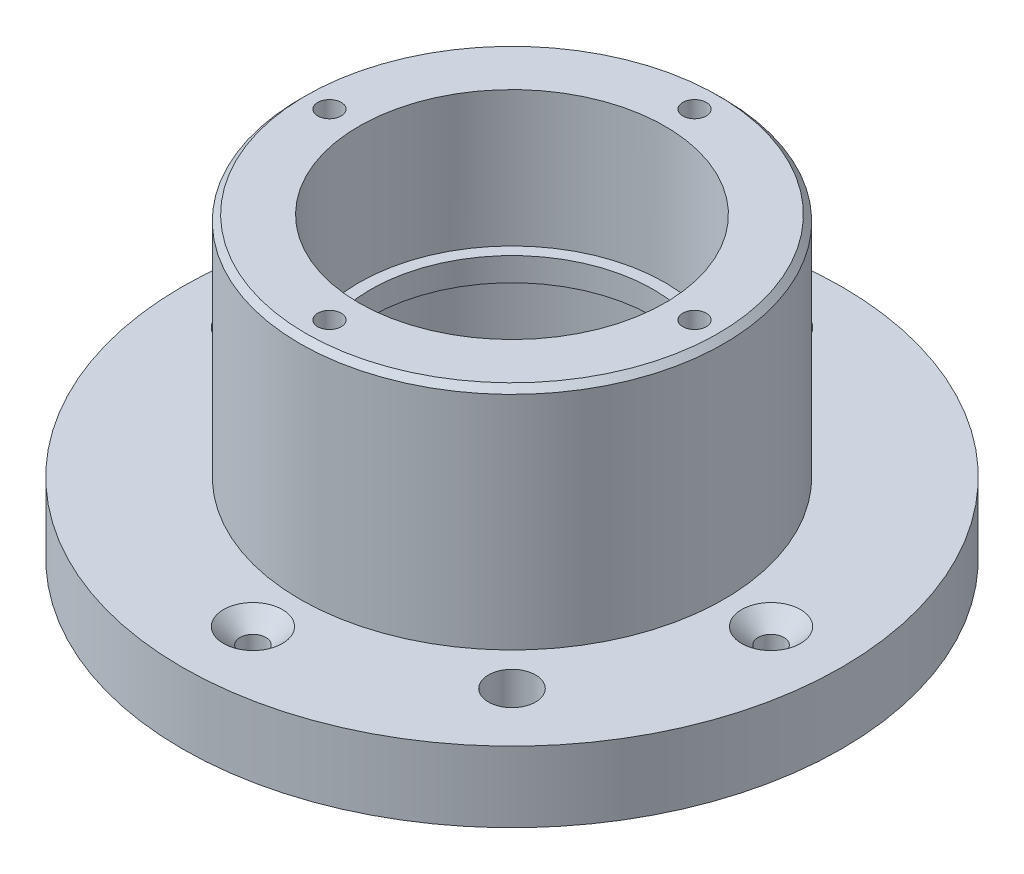
ISO-10303-21;
HEADER;
FILE_DESCRIPTION(('STEP AP214'),'2;1');
FILE_NAME('part.step','',(''),(''),'','','');
FILE_SCHEMA(('AUTOMOTIVE_DESIGN { 1 0 10303 214 1 1 1 1 }'));
ENDSEC;
DATA;
#1=APPLICATION_CONTEXT('core data for automotive mechanical design processes');
#2=APPLICATION_PROTOCOL_DEFINITION('international standard','automotive_design',2000,#1);
#3=PRODUCT_CONTEXT('',#1,'mechanical');
#4=PRODUCT('Part','Part','',(#3));
#5=PRODUCT_RELATED_PRODUCT_CATEGORY('part','',(#4));
#6=PRODUCT_DEFINITION_FORMATION('','',#4);
#7=PRODUCT_DEFINITION_CONTEXT('part definition',#1,'design');
#8=PRODUCT_DEFINITION('design','',#6,#7);
#9=PRODUCT_DEFINITION_SHAPE('','',#8);
#10=(LENGTH_UNIT() NAMED_UNIT(*) SI_UNIT(.MILLI.,.METRE.));
#11=(NAMED_UNIT(*) PLANE_ANGLE_UNIT() SI_UNIT($,.RADIAN.));
#12=(NAMED_UNIT(*) SI_UNIT($,.STERADIAN.) SOLID_ANGLE_UNIT());
#13=UNCERTAINTY_MEASURE_WITH_UNIT(LENGTH_MEASURE(1.E-05),#10,'distance_accuracy_value','');
#14=(GEOMETRIC_REPRESENTATION_CONTEXT(3) GLOBAL_UNCERTAINTY_ASSIGNED_CONTEXT((#13)) GLOBAL_UNIT_ASSIGNED_CONTEXT((#10,
#11,#12)) REPRESENTATION_CONTEXT('',''));
#15=CARTESIAN_POINT('',(0.,0.,0.));
#16=DIRECTION('',(0.,0.,1.));
#17=DIRECTION('',(1.,0.,0.));
#18=AXIS2_PLACEMENT_3D('',#15,#16,#17);
#19=CARTESIAN_POINT('',(0.,-36.7695526217005,0.));
#20=DIRECTION('',(0.,1.,0.));
#21=DIRECTION('',(0.,0.,1.));
#22=AXIS2_PLACEMENT_3D('',#19,#20,#21);
#23=CYLINDRICAL_SURFACE('',#22,13.);
#24=CARTESIAN_POINT('',(0.,23.3,0.));
#25=DIRECTION('',(0.,1.,0.));
#26=DIRECTION('',(0.,0.,1.));
#27=AXIS2_PLACEMENT_3D('',#24,#25,#26);
#28=CIRCLE('',#27,13.);
#29=CARTESIAN_POINT('',(0.,23.3,13.));
#30=VERTEX_POINT('',#29);
#31=EDGE_CURVE('E116',#30,#30,#28,.T.);
#32=ORIENTED_EDGE('',*,*,#31,.T.);
#33=EDGE_LOOP('',(#32));
#34=FACE_BOUND('',#33,.T.);
#35=CARTESIAN_POINT('',(0.,11.8,0.));
#36=DIRECTION('',(0.,-1.,0.));
#37=DIRECTION('',(0.,0.,-1.));
#38=AXIS2_PLACEMENT_3D('',#35,#36,#37);
#39=CIRCLE('',#38,13.);
#40=CARTESIAN_POINT('',(0.,11.8,-13.));
#41=VERTEX_POINT('',#40);
#42=EDGE_CURVE('E75',#41,#41,#39,.F.);
#43=ORIENTED_EDGE('',*,*,#42,.F.);
#44=EDGE_LOOP('',(#43));
#45=FACE_BOUND('',#44,.T.);
#46=ADVANCED_FACE('F39',(#34,#45),#23,.F.);
#47=CARTESIAN_POINT('',(0.,4.,0.));
#48=DIRECTION('',(0.,1.,0.));
#49=DIRECTION('',(0.,0.,1.));
#50=AXIS2_PLACEMENT_3D('',#47,#48,#49);
#51=PLANE('',#50);
#52=CARTESIAN_POINT('',(15.556349186104,4.,15.5563491861041));
#53=DIRECTION('',(0.,1.,0.));
#54=DIRECTION('',(0.,0.,1.));
#55=AXIS2_PLACEMENT_3D('',#52,#53,#54);
#56=CIRCLE('',#55,2.);
#57=CARTESIAN_POINT('',(15.556349186104,4.,17.5563491861041));
#58=VERTEX_POINT('',#57);
#59=EDGE_CURVE('E283',#58,#58,#56,.T.);
#60=ORIENTED_EDGE('',*,*,#59,.F.);
#61=EDGE_LOOP('',(#60));
#62=FACE_BOUND('',#61,.T.);
#63=CARTESIAN_POINT('',(22.,4.,4.60875536727294E-13));
#64=DIRECTION('',(0.,-1.,0.));
#65=DIRECTION('',(-1.,0.,0.));
#66=AXIS2_PLACEMENT_3D('',#63,#64,#65);
#67=CIRCLE('',#66,2.5);
#68=CARTESIAN_POINT('',(19.5,4.,4.3468942668597E-13));
#69=VERTEX_POINT('',#68);
#70=EDGE_CURVE('E77',#69,#69,#67,.T.);
#71=ORIENTED_EDGE('',*,*,#70,.T.);
#72=EDGE_LOOP('',(#71));
#73=FACE_BOUND('',#72,.T.);
#74=CARTESIAN_POINT('',(2.30437768363647E-13,4.,-22.));
#75=DIRECTION('',(0.,-1.,0.));
#76=DIRECTION('',(0.,0.,1.));
#77=AXIS2_PLACEMENT_3D('',#74,#75,#76);
#78=CIRCLE('',#77,2.5);
#79=CARTESIAN_POINT('',(2.30437768363647E-13,4.,-19.5));
#80=VERTEX_POINT('',#79);
#81=EDGE_CURVE('E73',#80,#80,#78,.T.);
#82=ORIENTED_EDGE('',*,*,#81,.T.);
#83=EDGE_LOOP('',(#82));
#84=FACE_BOUND('',#83,.T.);
#85=CARTESIAN_POINT('',(-22.,4.,-3.07250357818196E-13));
#86=DIRECTION('',(0.,-1.,0.));
#87=DIRECTION('',(1.,0.,0.));
#88=AXIS2_PLACEMENT_3D('',#85,#86,#87);
#89=CIRCLE('',#88,2.5);
#90=CARTESIAN_POINT('',(-19.5,4.,-2.98521654471088E-13));
#91=VERTEX_POINT('',#90);
#92=EDGE_CURVE('E69',#91,#91,#89,.T.);
#93=ORIENTED_EDGE('',*,*,#92,.T.);
#94=EDGE_LOOP('',(#93));
#95=FACE_BOUND('',#94,.T.);
#96=CARTESIAN_POINT('',(-2.30437768363647E-13,4.,22.));
#97=DIRECTION('',(0.,-1.,0.));
#98=DIRECTION('',(0.,0.,-1.));
#99=AXIS2_PLACEMENT_3D('',#96,#97,#98);
#100=CIRCLE('',#99,2.5);
#101=CARTESIAN_POINT('',(-2.30437768363647E-13,4.,19.5));
#102=VERTEX_POINT('',#101);
#103=EDGE_CURVE('E64',#102,#102,#100,.T.);
#104=ORIENTED_EDGE('',*,*,#103,.T.);
#105=EDGE_LOOP('',(#104));
#106=FACE_BOUND('',#105,.T.);
#107=CARTESIAN_POINT('',(0.,4.,0.));
#108=DIRECTION('',(0.,1.,0.));
#109=DIRECTION('',(0.,0.,1.));
#110=AXIS2_PLACEMENT_3D('',#107,#108,#109);
#111=CIRCLE('',#110,18.);
#112=CARTESIAN_POINT('',(0.,4.,18.));
#113=VERTEX_POINT('',#112);
#114=EDGE_CURVE('E140',#113,#113,#111,.T.);
#115=ORIENTED_EDGE('',*,*,#114,.F.);
#116=EDGE_LOOP('',(#115));
#117=FACE_BOUND('',#116,.T.);
#118=CARTESIAN_POINT('',(0.,4.,0.));
#119=DIRECTION('',(0.,1.,0.));
#120=DIRECTION('',(0.,0.,1.));
#121=AXIS2_PLACEMENT_3D('',#118,#119,#120);
#122=CIRCLE('',#121,28.);
#123=CARTESIAN_POINT('',(0.,4.,28.));
#124=VERTEX_POINT('',#123);
#125=EDGE_CURVE('E59',#124,#124,#122,.T.);
#126=ORIENTED_EDGE('',*,*,#125,.T.);
#127=EDGE_LOOP('',(#126));
#128=FACE_BOUND('',#127,.T.);
#129=ADVANCED_FACE('F170',(#62,#73,#84,#95,#106,#117,#128),#51,.T.);
#130=CARTESIAN_POINT('',(0.,0.,0.));
#131=DIRECTION('',(0.,1.,0.));
#132=DIRECTION('',(0.,0.,1.));
#133=AXIS2_PLACEMENT_3D('',#130,#131,#132);
#134=PLANE('',#133);
#135=CARTESIAN_POINT('',(15.556349186104,0.,15.5563491861041));
#136=DIRECTION('',(0.,1.,0.));
#137=DIRECTION('',(0.,0.,1.));
#138=AXIS2_PLACEMENT_3D('',#135,#136,#137);
#139=CIRCLE('',#138,2.);
#140=CARTESIAN_POINT('',(15.556349186104,0.,17.5563491861041));
#141=VERTEX_POINT('',#140);
#142=EDGE_CURVE('E43',#141,#141,#139,.T.);
#143=ORIENTED_EDGE('',*,*,#142,.T.);
#144=EDGE_LOOP('',(#143));
#145=FACE_BOUND('',#144,.T.);
#146=CARTESIAN_POINT('',(0.,0.,0.));
#147=DIRECTION('',(0.,-1.,0.));
#148=DIRECTION('',(0.,0.,-1.));
#149=AXIS2_PLACEMENT_3D('',#146,#147,#148);
#150=CIRCLE('',#149,15.);
#151=CARTESIAN_POINT('',(0.,0.,-15.));
#152=VERTEX_POINT('',#151);
#153=EDGE_CURVE('E78',#152,#152,#150,.T.);
#154=ORIENTED_EDGE('',*,*,#153,.F.);
#155=EDGE_LOOP('',(#154));
#156=FACE_BOUND('',#155,.T.);
#157=CARTESIAN_POINT('',(22.,0.,4.60875536727294E-13));
#158=DIRECTION('',(0.,1.,0.));
#159=DIRECTION('',(0.,0.,1.));
#160=AXIS2_PLACEMENT_3D('',#157,#158,#159);
#161=CIRCLE('',#160,1.1);
#162=CARTESIAN_POINT('',(22.,0.,1.10000000000046));
#163=VERTEX_POINT('',#162);
#164=EDGE_CURVE('E71',#163,#163,#161,.T.);
#165=ORIENTED_EDGE('',*,*,#164,.T.);
#166=EDGE_LOOP('',(#165));
#167=FACE_BOUND('',#166,.T.);
#168=CARTESIAN_POINT('',(2.30437768363647E-13,0.,-22.));
#169=DIRECTION('',(0.,1.,0.));
#170=DIRECTION('',(0.,0.,1.));
#171=AXIS2_PLACEMENT_3D('',#168,#169,#170);
#172=CIRCLE('',#171,1.1);
#173=CARTESIAN_POINT('',(2.30437768363647E-13,0.,-20.9));
#174=VERTEX_POINT('',#173);
#175=EDGE_CURVE('E66',#174,#174,#172,.T.);
#176=ORIENTED_EDGE('',*,*,#175,.T.);
#177=EDGE_LOOP('',(#176));
#178=FACE_BOUND('',#177,.T.);
#179=CARTESIAN_POINT('',(-22.,0.,-3.07250357818196E-13));
#180=DIRECTION('',(0.,1.,0.));
#181=DIRECTION('',(0.,0.,1.));
#182=AXIS2_PLACEMENT_3D('',#179,#180,#181);
#183=CIRCLE('',#182,1.1);
#184=CARTESIAN_POINT('',(-22.,0.,1.09999999999969));
#185=VERTEX_POINT('',#184);
#186=EDGE_CURVE('E61',#185,#185,#183,.T.);
#187=ORIENTED_EDGE('',*,*,#186,.T.);
#188=EDGE_LOOP('',(#187));
#189=FACE_BOUND('',#188,.T.);
#190=CARTESIAN_POINT('',(-2.30437768363647E-13,0.,22.));
#191=DIRECTION('',(0.,1.,0.));
#192=DIRECTION('',(0.,0.,1.));
#193=AXIS2_PLACEMENT_3D('',#190,#191,#192);
#194=CIRCLE('',#193,1.1);
#195=CARTESIAN_POINT('',(-2.30437768363647E-13,0.,23.1));
#196=VERTEX_POINT('',#195);
#197=EDGE_CURVE('E56',#196,#196,#194,.T.);
#198=ORIENTED_EDGE('',*,*,#197,.T.);
#199=EDGE_LOOP('',(#198));
#200=FACE_BOUND('',#199,.T.);
#201=CARTESIAN_POINT('',(0.,0.,0.));
#202=DIRECTION('',(0.,1.,0.));
#203=DIRECTION('',(0.,0.,1.));
#204=AXIS2_PLACEMENT_3D('',#201,#202,#203);
#205=CIRCLE('',#204,26.);
#206=CARTESIAN_POINT('',(0.,0.,26.));
#207=VERTEX_POINT('',#206);
#208=EDGE_CURVE('E139',#207,#207,#205,.T.);
#209=ORIENTED_EDGE('',*,*,#208,.F.);
#210=EDGE_LOOP('',(#209));
#211=FACE_BOUND('',#210,.T.);
#212=ADVANCED_FACE('F172',(#145,#156,#167,#178,#189,#200,#211),#134,.F.);
#213=CARTESIAN_POINT('',(0.,23.3,0.));
#214=DIRECTION('',(0.,-1.,0.));
#215=DIRECTION('',(0.,0.,-1.));
#216=AXIS2_PLACEMENT_3D('',#213,#214,#215);
#217=CYLINDRICAL_SURFACE('',#216,18.);
#218=CARTESIAN_POINT('',(0.,22.8,0.));
#219=DIRECTION('',(0.,1.,0.));
#220=DIRECTION('',(0.,0.,1.));
#221=AXIS2_PLACEMENT_3D('',#218,#219,#220);
#222=CIRCLE('',#221,18.);
#223=CARTESIAN_POINT('',(0.,22.8,18.));
#224=VERTEX_POINT('',#223);
#225=EDGE_CURVE('E11',#224,#224,#222,.F.);
#226=ORIENTED_EDGE('',*,*,#225,.T.);
#227=EDGE_LOOP('',(#226));
#228=FACE_BOUND('',#227,.T.);
#229=ORIENTED_EDGE('',*,*,#114,.T.);
#230=EDGE_LOOP('',(#229));
#231=FACE_BOUND('',#230,.T.);
#232=ADVANCED_FACE('F179',(#228,#231),#217,.T.);
#233=CARTESIAN_POINT('',(0.,23.3,0.));
#234=DIRECTION('',(0.,1.,0.));
#235=DIRECTION('',(0.,0.,1.));
#236=AXIS2_PLACEMENT_3D('',#233,#234,#235);
#237=PLANE('',#236);
#238=CARTESIAN_POINT('',(0.,23.3,0.));
#239=DIRECTION('',(0.,1.,0.));
#240=DIRECTION('',(0.,0.,1.));
#241=AXIS2_PLACEMENT_3D('',#238,#239,#240);
#242=CIRCLE('',#241,17.5);
#243=CARTESIAN_POINT('',(0.,23.3,17.5));
#244=VERTEX_POINT('',#243);
#245=EDGE_CURVE('E47',#244,#244,#242,.T.);
#246=ORIENTED_EDGE('',*,*,#245,.T.);
#247=EDGE_LOOP('',(#246));
#248=FACE_BOUND('',#247,.T.);
#249=CARTESIAN_POINT('',(-15.5,23.3,0.));
#250=DIRECTION('',(0.,1.,0.));
#251=DIRECTION('',(0.,0.,1.));
#252=AXIS2_PLACEMENT_3D('',#249,#250,#251);
#253=CIRCLE('',#252,1.);
#254=CARTESIAN_POINT('',(-15.5,23.3,1.));
#255=VERTEX_POINT('',#254);
#256=EDGE_CURVE('E117',#255,#255,#253,.T.);
#257=ORIENTED_EDGE('',*,*,#256,.F.);
#258=EDGE_LOOP('',(#257));
#259=FACE_BOUND('',#258,.T.);
#260=CARTESIAN_POINT('',(0.,23.3,-15.5));
#261=DIRECTION('',(0.,1.,0.));
#262=DIRECTION('',(0.,0.,1.));
#263=AXIS2_PLACEMENT_3D('',#260,#261,#262);
#264=CIRCLE('',#263,1.);
#265=CARTESIAN_POINT('',(0.,23.3,-14.5));
#266=VERTEX_POINT('',#265);
#267=EDGE_CURVE('E123',#266,#266,#264,.T.);
#268=ORIENTED_EDGE('',*,*,#267,.F.);
#269=EDGE_LOOP('',(#268));
#270=FACE_BOUND('',#269,.T.);
#271=CARTESIAN_POINT('',(15.5,23.3,1.08235921504137E-13));
#272=DIRECTION('',(0.,1.,0.));
#273=DIRECTION('',(0.,0.,1.));
#274=AXIS2_PLACEMENT_3D('',#271,#272,#273);
#275=CIRCLE('',#274,1.);
#276=CARTESIAN_POINT('',(15.5,23.3,1.00000000000011));
#277=VERTEX_POINT('',#276);
#278=EDGE_CURVE('E129',#277,#277,#275,.T.);
#279=ORIENTED_EDGE('',*,*,#278,.F.);
#280=EDGE_LOOP('',(#279));
#281=FACE_BOUND('',#280,.T.);
#282=CARTESIAN_POINT('',(-1.62353882256206E-13,23.3,15.5));
#283=DIRECTION('',(0.,1.,0.));
#284=DIRECTION('',(0.,0.,1.));
#285=AXIS2_PLACEMENT_3D('',#282,#283,#284);
#286=CIRCLE('',#285,1.);
#287=CARTESIAN_POINT('',(-1.62353882256206E-13,23.3,16.5));
#288=VERTEX_POINT('',#287);
#289=EDGE_CURVE('E110',#288,#288,#286,.T.);
#290=ORIENTED_EDGE('',*,*,#289,.F.);
#291=EDGE_LOOP('',(#290));
#292=FACE_BOUND('',#291,.T.);
#293=ORIENTED_EDGE('',*,*,#31,.F.);
#294=EDGE_LOOP('',(#293));
#295=FACE_BOUND('',#294,.T.);
#296=ADVANCED_FACE('F190',(#248,#259,#270,#281,#292,#295),#237,.T.);
#297=CARTESIAN_POINT('',(-1.62353882256206E-13,18.3,15.5));
#298=DIRECTION('',(0.,1.,0.));
#299=DIRECTION('',(0.,0.,1.));
#300=AXIS2_PLACEMENT_3D('',#297,#298,#299);
#301=CYLINDRICAL_SURFACE('',#300,1.);
#302=CARTESIAN_POINT('',(-1.62353882256206E-13,18.3,15.5));
#303=DIRECTION('',(0.,1.,0.));
#304=DIRECTION('',(0.,0.,1.));
#305=AXIS2_PLACEMENT_3D('',#302,#303,#304);
#306=CIRCLE('',#305,1.);
#307=CARTESIAN_POINT('',(-1.62353882256206E-13,18.3,16.5));
#308=VERTEX_POINT('',#307);
#309=EDGE_CURVE('E132',#308,#308,#306,.T.);
#310=ORIENTED_EDGE('',*,*,#309,.F.);
#311=EDGE_LOOP('',(#310));
#312=FACE_BOUND('',#311,.T.);
#313=ORIENTED_EDGE('',*,*,#289,.T.);
#314=EDGE_LOOP('',(#313));
#315=FACE_BOUND('',#314,.T.);
#316=ADVANCED_FACE('F192',(#312,#315),#301,.F.);
#317=CARTESIAN_POINT('',(-1.62353882256206E-13,18.3,15.5));
#318=DIRECTION('',(0.,1.,0.));
#319=DIRECTION('',(0.,0.,1.));
#320=AXIS2_PLACEMENT_3D('',#317,#318,#319);
#321=PLANE('',#320);
#322=ORIENTED_EDGE('',*,*,#309,.T.);
#323=EDGE_LOOP('',(#322));
#324=FACE_BOUND('',#323,.T.);
#325=ADVANCED_FACE('F197',(#324),#321,.T.);
#326=CARTESIAN_POINT('',(15.5,18.3,1.08235921504137E-13));
#327=DIRECTION('',(0.,1.,0.));
#328=DIRECTION('',(0.,0.,1.));
#329=AXIS2_PLACEMENT_3D('',#326,#327,#328);
#330=CYLINDRICAL_SURFACE('',#329,1.);
#331=CARTESIAN_POINT('',(15.5,18.3,1.08235921504137E-13));
#332=DIRECTION('',(0.,1.,0.));
#333=DIRECTION('',(0.,0.,1.));
#334=AXIS2_PLACEMENT_3D('',#331,#332,#333);
#335=CIRCLE('',#334,1.);
#336=CARTESIAN_POINT('',(15.5,18.3,1.00000000000011));
#337=VERTEX_POINT('',#336);
#338=EDGE_CURVE('E126',#337,#337,#335,.T.);
#339=ORIENTED_EDGE('',*,*,#338,.F.);
#340=EDGE_LOOP('',(#339));
#341=FACE_BOUND('',#340,.T.);
#342=ORIENTED_EDGE('',*,*,#278,.T.);
#343=EDGE_LOOP('',(#342));
#344=FACE_BOUND('',#343,.T.);
#345=ADVANCED_FACE('F201',(#341,#344),#330,.F.);
#346=CARTESIAN_POINT('',(15.5,18.3,1.08235921504137E-13));
#347=DIRECTION('',(0.,1.,0.));
#348=DIRECTION('',(0.,0.,1.));
#349=AXIS2_PLACEMENT_3D('',#346,#347,#348);
#350=PLANE('',#349);
#351=ORIENTED_EDGE('',*,*,#338,.T.);
#352=EDGE_LOOP('',(#351));
#353=FACE_BOUND('',#352,.T.);
#354=ADVANCED_FACE('F205',(#353),#350,.T.);
#355=CARTESIAN_POINT('',(0.,18.3,-15.5));
#356=DIRECTION('',(0.,1.,0.));
#357=DIRECTION('',(0.,0.,1.));
#358=AXIS2_PLACEMENT_3D('',#355,#356,#357);
#359=CYLINDRICAL_SURFACE('',#358,1.);
#360=CARTESIAN_POINT('',(0.,18.3,-15.5));
#361=DIRECTION('',(0.,1.,0.));
#362=DIRECTION('',(0.,0.,1.));
#363=AXIS2_PLACEMENT_3D('',#360,#361,#362);
#364=CIRCLE('',#363,1.);
#365=CARTESIAN_POINT('',(0.,18.3,-14.5));
#366=VERTEX_POINT('',#365);
#367=EDGE_CURVE('E120',#366,#366,#364,.T.);
#368=ORIENTED_EDGE('',*,*,#367,.F.);
#369=EDGE_LOOP('',(#368));
#370=FACE_BOUND('',#369,.T.);
#371=ORIENTED_EDGE('',*,*,#267,.T.);
#372=EDGE_LOOP('',(#371));
#373=FACE_BOUND('',#372,.T.);
#374=ADVANCED_FACE('F209',(#370,#373),#359,.F.);
#375=CARTESIAN_POINT('',(0.,18.3,-15.5));
#376=DIRECTION('',(0.,1.,0.));
#377=DIRECTION('',(0.,0.,1.));
#378=AXIS2_PLACEMENT_3D('',#375,#376,#377);
#379=PLANE('',#378);
#380=ORIENTED_EDGE('',*,*,#367,.T.);
#381=EDGE_LOOP('',(#380));
#382=FACE_BOUND('',#381,.T.);
#383=ADVANCED_FACE('F213',(#382),#379,.T.);
#384=CARTESIAN_POINT('',(-15.5,18.3,0.));
#385=DIRECTION('',(0.,1.,0.));
#386=DIRECTION('',(0.,0.,1.));
#387=AXIS2_PLACEMENT_3D('',#384,#385,#386);
#388=CYLINDRICAL_SURFACE('',#387,1.);
#389=CARTESIAN_POINT('',(-15.5,18.3,0.));
#390=DIRECTION('',(0.,1.,0.));
#391=DIRECTION('',(0.,0.,1.));
#392=AXIS2_PLACEMENT_3D('',#389,#390,#391);
#393=CIRCLE('',#392,1.);
#394=CARTESIAN_POINT('',(-15.5,18.3,1.));
#395=VERTEX_POINT('',#394);
#396=EDGE_CURVE('E113',#395,#395,#393,.T.);
#397=ORIENTED_EDGE('',*,*,#396,.F.);
#398=EDGE_LOOP('',(#397));
#399=FACE_BOUND('',#398,.T.);
#400=ORIENTED_EDGE('',*,*,#256,.T.);
#401=EDGE_LOOP('',(#400));
#402=FACE_BOUND('',#401,.T.);
#403=ADVANCED_FACE('F217',(#399,#402),#388,.F.);
#404=CARTESIAN_POINT('',(-15.5,18.3,0.));
#405=DIRECTION('',(0.,1.,0.));
#406=DIRECTION('',(0.,0.,1.));
#407=AXIS2_PLACEMENT_3D('',#404,#405,#406);
#408=PLANE('',#407);
#409=ORIENTED_EDGE('',*,*,#396,.T.);
#410=EDGE_LOOP('',(#409));
#411=FACE_BOUND('',#410,.T.);
#412=ADVANCED_FACE('F221',(#411),#408,.T.);
#413=CARTESIAN_POINT('',(0.,-2.,0.));
#414=DIRECTION('',(0.,1.,0.));
#415=DIRECTION('',(0.,0.,1.));
#416=AXIS2_PLACEMENT_3D('',#413,#414,#415);
#417=CYLINDRICAL_SURFACE('',#416,26.);
#418=CARTESIAN_POINT('',(0.,-1.49999999999999,0.));
#419=DIRECTION('',(0.,1.,0.));
#420=DIRECTION('',(0.,0.,1.));
#421=AXIS2_PLACEMENT_3D('',#418,#419,#420);
#422=CIRCLE('',#421,26.);
#423=CARTESIAN_POINT('',(0.,-1.49999999999999,26.));
#424=VERTEX_POINT('',#423);
#425=EDGE_CURVE('E52',#424,#424,#422,.F.);
#426=ORIENTED_EDGE('',*,*,#425,.T.);
#427=EDGE_LOOP('',(#426));
#428=FACE_BOUND('',#427,.T.);
#429=ORIENTED_EDGE('',*,*,#208,.T.);
#430=EDGE_LOOP('',(#429));
#431=FACE_BOUND('',#430,.T.);
#432=ADVANCED_FACE('F150',(#428,#431),#417,.F.);
#433=CARTESIAN_POINT('',(0.,-2.,0.));
#434=DIRECTION('',(0.,1.,0.));
#435=DIRECTION('',(0.,0.,1.));
#436=AXIS2_PLACEMENT_3D('',#433,#434,#435);
#437=CYLINDRICAL_SURFACE('',#436,28.);
#438=CARTESIAN_POINT('',(0.,-2.,0.));
#439=DIRECTION('',(0.,1.,0.));
#440=DIRECTION('',(0.,0.,1.));
#441=AXIS2_PLACEMENT_3D('',#438,#439,#440);
#442=CIRCLE('',#441,28.);
#443=CARTESIAN_POINT('',(0.,-2.,28.));
#444=VERTEX_POINT('',#443);
#445=EDGE_CURVE('E107',#444,#444,#442,.T.);
#446=ORIENTED_EDGE('',*,*,#445,.T.);
#447=EDGE_LOOP('',(#446));
#448=FACE_BOUND('',#447,.T.);
#449=ORIENTED_EDGE('',*,*,#125,.F.);
#450=EDGE_LOOP('',(#449));
#451=FACE_BOUND('',#450,.T.);
#452=ADVANCED_FACE('F161',(#448,#451),#437,.T.);
#453=CARTESIAN_POINT('',(0.,-2.,0.));
#454=DIRECTION('',(0.,1.,0.));
#455=DIRECTION('',(0.,0.,1.));
#456=AXIS2_PLACEMENT_3D('',#453,#454,#455);
#457=PLANE('',#456);
#458=CARTESIAN_POINT('',(0.,-2.,0.));
#459=DIRECTION('',(0.,1.,0.));
#460=DIRECTION('',(0.,0.,1.));
#461=AXIS2_PLACEMENT_3D('',#458,#459,#460);
#462=CIRCLE('',#461,26.5);
#463=CARTESIAN_POINT('',(0.,-2.,26.5));
#464=VERTEX_POINT('',#463);
#465=EDGE_CURVE('E143',#464,#464,#462,.T.);
#466=ORIENTED_EDGE('',*,*,#465,.T.);
#467=EDGE_LOOP('',(#466));
#468=FACE_BOUND('',#467,.T.);
#469=ORIENTED_EDGE('',*,*,#445,.F.);
#470=EDGE_LOOP('',(#469));
#471=FACE_BOUND('',#470,.T.);
#472=ADVANCED_FACE('F156',(#468,#471),#457,.F.);
#473=CARTESIAN_POINT('',(0.,-2.,0.));
#474=DIRECTION('',(0.,-1.,0.));
#475=DIRECTION('',(0.,0.,-1.));
#476=AXIS2_PLACEMENT_3D('',#473,#474,#475);
#477=CONICAL_SURFACE('',#476,26.5,0.785398163397438);
#478=ORIENTED_EDGE('',*,*,#425,.F.);
#479=EDGE_LOOP('',(#478));
#480=FACE_BOUND('',#479,.T.);
#481=ORIENTED_EDGE('',*,*,#465,.F.);
#482=EDGE_LOOP('',(#481));
#483=FACE_BOUND('',#482,.T.);
#484=ADVANCED_FACE('F153',(#480,#483),#477,.F.);
#485=CARTESIAN_POINT('',(0.,23.3,0.));
#486=DIRECTION('',(0.,-1.,0.));
#487=DIRECTION('',(0.,0.,-1.));
#488=AXIS2_PLACEMENT_3D('',#485,#486,#487);
#489=CONICAL_SURFACE('',#488,17.5,0.785398163397448);
#490=ORIENTED_EDGE('',*,*,#225,.F.);
#491=EDGE_LOOP('',(#490));
#492=FACE_BOUND('',#491,.T.);
#493=ORIENTED_EDGE('',*,*,#245,.F.);
#494=EDGE_LOOP('',(#493));
#495=FACE_BOUND('',#494,.T.);
#496=ADVANCED_FACE('F41',(#492,#495),#489,.T.);
#497=CARTESIAN_POINT('',(-2.30437768363647E-13,-20.7688212942876,22.));
#498=DIRECTION('',(0.,-1.,0.));
#499=DIRECTION('',(0.,0.,-1.));
#500=AXIS2_PLACEMENT_3D('',#497,#498,#499);
#501=CYLINDRICAL_SURFACE('',#500,1.1);
#502=CARTESIAN_POINT('',(-2.30437768363647E-13,2.6480357152701,22.));
#503=DIRECTION('',(0.,-1.,0.));
#504=DIRECTION('',(0.,0.,-1.));
#505=AXIS2_PLACEMENT_3D('',#502,#503,#504);
#506=CIRCLE('',#505,1.1);
#507=CARTESIAN_POINT('',(-2.30437768363647E-13,2.6480357152701,20.9));
#508=VERTEX_POINT('',#507);
#509=EDGE_CURVE('E60',#508,#508,#506,.T.);
#510=ORIENTED_EDGE('',*,*,#509,.F.);
#511=EDGE_LOOP('',(#510));
#512=FACE_BOUND('',#511,.T.);
#513=ORIENTED_EDGE('',*,*,#197,.F.);
#514=EDGE_LOOP('',(#513));
#515=FACE_BOUND('',#514,.T.);
#516=ADVANCED_FACE('F228',(#512,#515),#501,.F.);
#517=CARTESIAN_POINT('',(-2.30437768363647E-13,2.6480357152701,22.));
#518=DIRECTION('',(0.,1.,0.));
#519=DIRECTION('',(0.,0.,1.));
#520=AXIS2_PLACEMENT_3D('',#517,#518,#519);
#521=CONICAL_SURFACE('',#520,1.1,0.802851455917392);
#522=ORIENTED_EDGE('',*,*,#103,.F.);
#523=EDGE_LOOP('',(#522));
#524=FACE_BOUND('',#523,.T.);
#525=ORIENTED_EDGE('',*,*,#509,.T.);
#526=EDGE_LOOP('',(#525));
#527=FACE_BOUND('',#526,.T.);
#528=ADVANCED_FACE('F231',(#524,#527),#521,.F.);
#529=CARTESIAN_POINT('',(-22.,-20.7688212942876,-3.07250357818196E-13));
#530=DIRECTION('',(0.,-1.,0.));
#531=DIRECTION('',(1.,0.,0.));
#532=AXIS2_PLACEMENT_3D('',#529,#530,#531);
#533=CYLINDRICAL_SURFACE('',#532,1.1);
#534=CARTESIAN_POINT('',(-22.,2.6480357152701,-3.07250357818196E-13));
#535=DIRECTION('',(0.,-1.,0.));
#536=DIRECTION('',(1.,0.,0.));
#537=AXIS2_PLACEMENT_3D('',#534,#535,#536);
#538=CIRCLE('',#537,1.1);
#539=CARTESIAN_POINT('',(-20.9,2.6480357152701,-3.03409728345468E-13));
#540=VERTEX_POINT('',#539);
#541=EDGE_CURVE('E65',#540,#540,#538,.T.);
#542=ORIENTED_EDGE('',*,*,#541,.F.);
#543=EDGE_LOOP('',(#542));
#544=FACE_BOUND('',#543,.T.);
#545=ORIENTED_EDGE('',*,*,#186,.F.);
#546=EDGE_LOOP('',(#545));
#547=FACE_BOUND('',#546,.T.);
#548=ADVANCED_FACE('F235',(#544,#547),#533,.F.);
#549=CARTESIAN_POINT('',(-22.,2.6480357152701,-3.07250357818196E-13));
#550=DIRECTION('',(0.,1.,0.));
#551=DIRECTION('',(-1.,0.,0.));
#552=AXIS2_PLACEMENT_3D('',#549,#550,#551);
#553=CONICAL_SURFACE('',#552,1.1,0.802851455917392);
#554=ORIENTED_EDGE('',*,*,#92,.F.);
#555=EDGE_LOOP('',(#554));
#556=FACE_BOUND('',#555,.T.);
#557=ORIENTED_EDGE('',*,*,#541,.T.);
#558=EDGE_LOOP('',(#557));
#559=FACE_BOUND('',#558,.T.);
#560=ADVANCED_FACE('F239',(#556,#559),#553,.F.);
#561=CARTESIAN_POINT('',(2.30437768363647E-13,-20.7688212942876,-22.));
#562=DIRECTION('',(0.,-1.,0.));
#563=DIRECTION('',(0.,0.,1.));
#564=AXIS2_PLACEMENT_3D('',#561,#562,#563);
#565=CYLINDRICAL_SURFACE('',#564,1.1);
#566=CARTESIAN_POINT('',(2.30437768363647E-13,2.6480357152701,-22.));
#567=DIRECTION('',(0.,-1.,0.));
#568=DIRECTION('',(0.,0.,1.));
#569=AXIS2_PLACEMENT_3D('',#566,#567,#568);
#570=CIRCLE('',#569,1.1);
#571=CARTESIAN_POINT('',(2.30437768363647E-13,2.6480357152701,-20.9));
#572=VERTEX_POINT('',#571);
#573=EDGE_CURVE('E70',#572,#572,#570,.T.);
#574=ORIENTED_EDGE('',*,*,#573,.F.);
#575=EDGE_LOOP('',(#574));
#576=FACE_BOUND('',#575,.T.);
#577=ORIENTED_EDGE('',*,*,#175,.F.);
#578=EDGE_LOOP('',(#577));
#579=FACE_BOUND('',#578,.T.);
#580=ADVANCED_FACE('F243',(#576,#579),#565,.F.);
#581=CARTESIAN_POINT('',(2.30437768363647E-13,2.6480357152701,-22.));
#582=DIRECTION('',(0.,1.,0.));
#583=DIRECTION('',(0.,0.,-1.));
#584=AXIS2_PLACEMENT_3D('',#581,#582,#583);
#585=CONICAL_SURFACE('',#584,1.1,0.802851455917392);
#586=ORIENTED_EDGE('',*,*,#81,.F.);
#587=EDGE_LOOP('',(#586));
#588=FACE_BOUND('',#587,.T.);
#589=ORIENTED_EDGE('',*,*,#573,.T.);
#590=EDGE_LOOP('',(#589));
#591=FACE_BOUND('',#590,.T.);
#592=ADVANCED_FACE('F247',(#588,#591),#585,.F.);
#593=CARTESIAN_POINT('',(22.,-20.7688212942876,4.60875536727294E-13));
#594=DIRECTION('',(0.,-1.,0.));
#595=DIRECTION('',(-1.,0.,0.));
#596=AXIS2_PLACEMENT_3D('',#593,#594,#595);
#597=CYLINDRICAL_SURFACE('',#596,1.1);
#598=CARTESIAN_POINT('',(22.,2.6480357152701,4.60875536727294E-13));
#599=DIRECTION('',(0.,-1.,0.));
#600=DIRECTION('',(-1.,0.,0.));
#601=AXIS2_PLACEMENT_3D('',#598,#599,#600);
#602=CIRCLE('',#601,1.1);
#603=CARTESIAN_POINT('',(20.9,2.6480357152701,4.49353648309111E-13));
#604=VERTEX_POINT('',#603);
#605=EDGE_CURVE('E74',#604,#604,#602,.T.);
#606=ORIENTED_EDGE('',*,*,#605,.F.);
#607=EDGE_LOOP('',(#606));
#608=FACE_BOUND('',#607,.T.);
#609=ORIENTED_EDGE('',*,*,#164,.F.);
#610=EDGE_LOOP('',(#609));
#611=FACE_BOUND('',#610,.T.);
#612=ADVANCED_FACE('F251',(#608,#611),#597,.F.);
#613=CARTESIAN_POINT('',(22.,2.6480357152701,4.60875536727294E-13));
#614=DIRECTION('',(0.,1.,0.));
#615=DIRECTION('',(1.,0.,0.));
#616=AXIS2_PLACEMENT_3D('',#613,#614,#615);
#617=CONICAL_SURFACE('',#616,1.1,0.802851455917392);
#618=ORIENTED_EDGE('',*,*,#70,.F.);
#619=EDGE_LOOP('',(#618));
#620=FACE_BOUND('',#619,.T.);
#621=ORIENTED_EDGE('',*,*,#605,.T.);
#622=EDGE_LOOP('',(#621));
#623=FACE_BOUND('',#622,.T.);
#624=ADVANCED_FACE('F255',(#620,#623),#617,.F.);
#625=CARTESIAN_POINT('',(0.,11.8,0.));
#626=DIRECTION('',(0.,-1.,0.));
#627=DIRECTION('',(0.,0.,-1.));
#628=AXIS2_PLACEMENT_3D('',#625,#626,#627);
#629=CYLINDRICAL_SURFACE('',#628,15.);
#630=CARTESIAN_POINT('',(-5.55831898556975E-13,9.8,1.68351181665354E-13));
#631=DIRECTION('',(0.,-1.,0.));
#632=DIRECTION('',(0.,0.,-1.));
#633=AXIS2_PLACEMENT_3D('',#630,#631,#632);
#634=CIRCLE('',#633,14.9999999999994);
#635=CARTESIAN_POINT('',(-5.55831898556975E-13,9.8,-14.9999999999993));
#636=VERTEX_POINT('',#635);
#637=EDGE_CURVE('E84',#636,#636,#634,.T.);
#638=ORIENTED_EDGE('',*,*,#637,.F.);
#639=EDGE_LOOP('',(#638));
#640=FACE_BOUND('',#639,.T.);
#641=ORIENTED_EDGE('',*,*,#153,.T.);
#642=EDGE_LOOP('',(#641));
#643=FACE_BOUND('',#642,.T.);
#644=ADVANCED_FACE('F259',(#640,#643),#629,.F.);
#645=CARTESIAN_POINT('',(-5.55831898556975E-13,11.8,1.68351181665354E-13));
#646=DIRECTION('',(0.,-1.,0.));
#647=DIRECTION('',(0.,0.,-1.));
#648=AXIS2_PLACEMENT_3D('',#645,#646,#647);
#649=PLANE('',#648);
#650=CARTESIAN_POINT('',(-5.55831898556975E-13,11.8,1.68351181665354E-13));
#651=DIRECTION('',(0.,-1.,0.));
#652=DIRECTION('',(0.,0.,-1.));
#653=AXIS2_PLACEMENT_3D('',#650,#651,#652);
#654=CIRCLE('',#653,12.);
#655=CARTESIAN_POINT('',(-5.55831898556975E-13,11.8,-11.9999999999998));
#656=VERTEX_POINT('',#655);
#657=EDGE_CURVE('E286',#656,#656,#654,.T.);
#658=ORIENTED_EDGE('',*,*,#657,.T.);
#659=EDGE_LOOP('',(#658));
#660=FACE_BOUND('',#659,.T.);
#661=ORIENTED_EDGE('',*,*,#42,.T.);
#662=EDGE_LOOP('',(#661));
#663=FACE_BOUND('',#662,.T.);
#664=ADVANCED_FACE('F263',(#660,#663),#649,.F.);
#665=CARTESIAN_POINT('',(-5.55831898556975E-13,9.8,1.68351181665354E-13));
#666=DIRECTION('',(0.,-1.,0.));
#667=DIRECTION('',(0.,0.,-1.));
#668=AXIS2_PLACEMENT_3D('',#665,#666,#667);
#669=PLANE('',#668);
#670=ORIENTED_EDGE('',*,*,#637,.T.);
#671=EDGE_LOOP('',(#670));
#672=FACE_BOUND('',#671,.T.);
#673=CARTESIAN_POINT('',(-5.55831898556975E-13,9.8,1.68351181665354E-13));
#674=DIRECTION('',(0.,-1.,0.));
#675=DIRECTION('',(0.,0.,-1.));
#676=AXIS2_PLACEMENT_3D('',#673,#674,#675);
#677=CIRCLE('',#676,12.);
#678=CARTESIAN_POINT('',(-5.55831898556975E-13,9.8,-11.9999999999998));
#679=VERTEX_POINT('',#678);
#680=EDGE_CURVE('E89',#679,#679,#677,.T.);
#681=ORIENTED_EDGE('',*,*,#680,.F.);
#682=EDGE_LOOP('',(#681));
#683=FACE_BOUND('',#682,.T.);
#684=ADVANCED_FACE('F267',(#672,#683),#669,.T.);
#685=CARTESIAN_POINT('',(-5.55831898556975E-13,9.8,1.68351181665354E-13));
#686=DIRECTION('',(0.,1.,0.));
#687=DIRECTION('',(0.,0.,1.));
#688=AXIS2_PLACEMENT_3D('',#685,#686,#687);
#689=CYLINDRICAL_SURFACE('',#688,12.);
#690=ORIENTED_EDGE('',*,*,#680,.T.);
#691=EDGE_LOOP('',(#690));
#692=FACE_BOUND('',#691,.T.);
#693=ORIENTED_EDGE('',*,*,#657,.F.);
#694=EDGE_LOOP('',(#693));
#695=FACE_BOUND('',#694,.T.);
#696=ADVANCED_FACE('F271',(#692,#695),#689,.F.);
#697=CARTESIAN_POINT('',(15.556349186104,-6.,15.5563491861041));
#698=DIRECTION('',(0.,1.,0.));
#699=DIRECTION('',(0.,0.,1.));
#700=AXIS2_PLACEMENT_3D('',#697,#698,#699);
#701=CYLINDRICAL_SURFACE('',#700,2.);
#702=ORIENTED_EDGE('',*,*,#59,.T.);
#703=EDGE_LOOP('',(#702));
#704=FACE_BOUND('',#703,.T.);
#705=ORIENTED_EDGE('',*,*,#142,.F.);
#706=EDGE_LOOP('',(#705));
#707=FACE_BOUND('',#706,.T.);
#708=ADVANCED_FACE('F275',(#704,#707),#701,.F.);
#709=CLOSED_SHELL('',(#46,#129,#212,#232,#296,#316,#325,#345,#354,#374,#383,#403,#412,#432,#452,
#472,#484,#496,#516,#528,#548,#560,#580,#592,#612,#624,#644,#664,#684,#696,#708));
#710=MANIFOLD_SOLID_BREP('B2',#709);
#711=ADVANCED_BREP_SHAPE_REPRESENTATION('',(#18,#710),#14);
#712=SHAPE_DEFINITION_REPRESENTATION(#9,#711);
ENDSEC;
END-ISO-10303-21;
